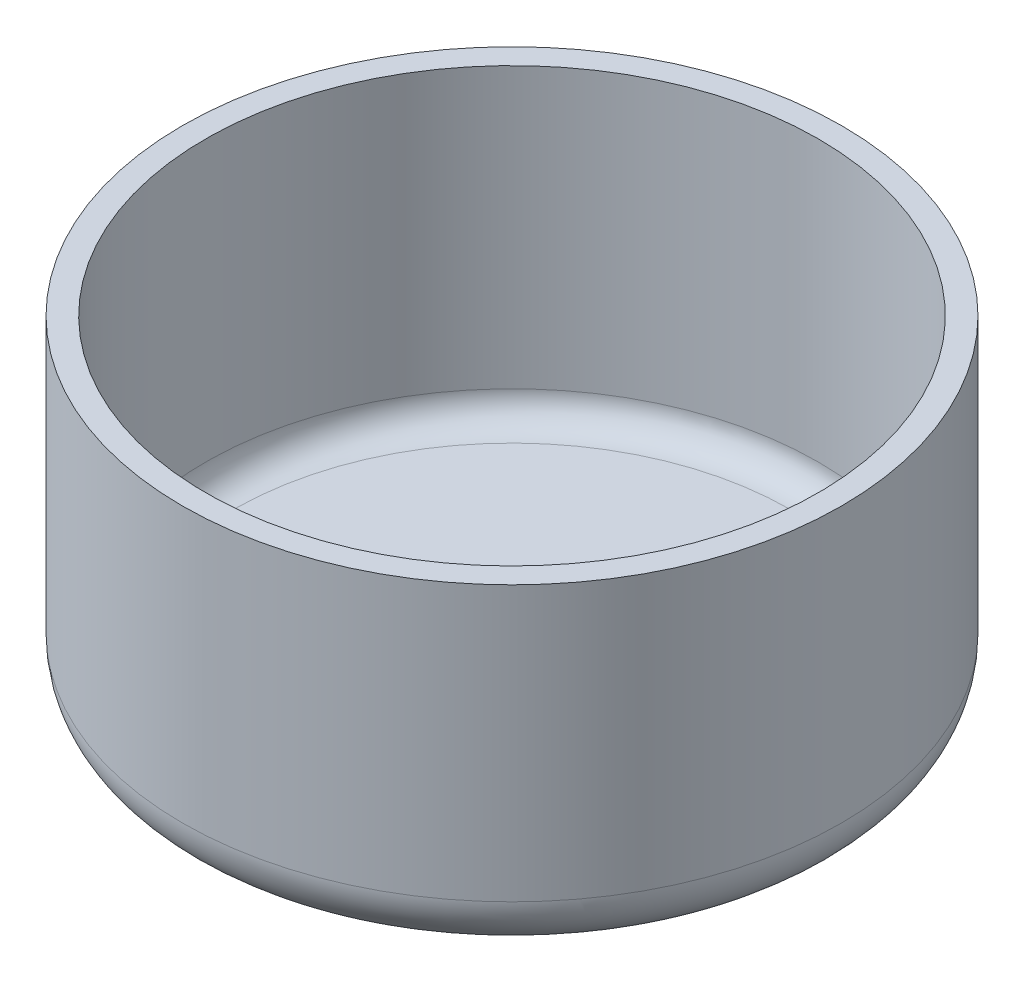
ISO-10303-21;
HEADER;
FILE_DESCRIPTION(('STEP AP214'),'2;1');
FILE_NAME('part.step','',(''),(''),'','','');
FILE_SCHEMA(('AUTOMOTIVE_DESIGN { 1 0 10303 214 1 1 1 1 }'));
ENDSEC;
DATA;
#1=APPLICATION_CONTEXT('core data for automotive mechanical design processes');
#2=APPLICATION_PROTOCOL_DEFINITION('international standard','automotive_design',2000,#1);
#3=PRODUCT_CONTEXT('',#1,'mechanical');
#4=PRODUCT('Part','Part','',(#3));
#5=PRODUCT_RELATED_PRODUCT_CATEGORY('part','',(#4));
#6=PRODUCT_DEFINITION_FORMATION('','',#4);
#7=PRODUCT_DEFINITION_CONTEXT('part definition',#1,'design');
#8=PRODUCT_DEFINITION('design','',#6,#7);
#9=PRODUCT_DEFINITION_SHAPE('','',#8);
#10=(LENGTH_UNIT() NAMED_UNIT(*) SI_UNIT(.MILLI.,.METRE.));
#11=(NAMED_UNIT(*) PLANE_ANGLE_UNIT() SI_UNIT($,.RADIAN.));
#12=(NAMED_UNIT(*) SI_UNIT($,.STERADIAN.) SOLID_ANGLE_UNIT());
#13=UNCERTAINTY_MEASURE_WITH_UNIT(LENGTH_MEASURE(1.E-05),#10,'distance_accuracy_value','');
#14=(GEOMETRIC_REPRESENTATION_CONTEXT(3) GLOBAL_UNCERTAINTY_ASSIGNED_CONTEXT((#13)) GLOBAL_UNIT_ASSIGNED_CONTEXT((#10,
#11,#12)) REPRESENTATION_CONTEXT('',''));
#15=CARTESIAN_POINT('',(0.,0.,0.));
#16=DIRECTION('',(0.,0.,1.));
#17=DIRECTION('',(1.,0.,0.));
#18=AXIS2_PLACEMENT_3D('',#15,#16,#17);
#19=CARTESIAN_POINT('',(0.,0.,0.));
#20=DIRECTION('',(0.,-1.,0.));
#21=DIRECTION('',(0.,0.,-1.));
#22=AXIS2_PLACEMENT_3D('',#19,#20,#21);
#23=CYLINDRICAL_SURFACE('',#22,3.302);
#24=CARTESIAN_POINT('',(0.,0.,0.));
#25=DIRECTION('',(0.,-1.,0.));
#26=DIRECTION('',(0.,0.,-1.));
#27=AXIS2_PLACEMENT_3D('',#24,#25,#26);
#28=CIRCLE('',#27,3.302);
#29=CARTESIAN_POINT('',(0.,0.,-3.302));
#30=VERTEX_POINT('',#29);
#31=EDGE_CURVE('E10',#30,#30,#28,.T.);
#32=ORIENTED_EDGE('',*,*,#31,.T.);
#33=EDGE_LOOP('',(#32));
#34=FACE_BOUND('',#33,.T.);
#35=CARTESIAN_POINT('',(0.,0.8382,0.));
#36=DIRECTION('',(0.,-1.,0.));
#37=DIRECTION('',(0.,0.,-1.));
#38=AXIS2_PLACEMENT_3D('',#35,#36,#37);
#39=CIRCLE('',#38,3.302);
#40=CARTESIAN_POINT('',(0.,0.8382,-3.302));
#41=VERTEX_POINT('',#40);
#42=EDGE_CURVE('E61',#41,#41,#39,.T.);
#43=ORIENTED_EDGE('',*,*,#42,.F.);
#44=EDGE_LOOP('',(#43));
#45=FACE_BOUND('',#44,.T.);
#46=ADVANCED_FACE('F33',(#34,#45),#23,.F.);
#47=CARTESIAN_POINT('',(3.302,0.,0.));
#48=DIRECTION('',(0.,-1.,0.));
#49=DIRECTION('',(0.,0.,-1.));
#50=AXIS2_PLACEMENT_3D('',#47,#48,#49);
#51=PLANE('',#50);
#52=CARTESIAN_POINT('',(0.,0.,0.));
#53=DIRECTION('',(0.,-1.,0.));
#54=DIRECTION('',(0.,0.,-1.));
#55=AXIS2_PLACEMENT_3D('',#52,#53,#54);
#56=CIRCLE('',#55,9.9314);
#57=CARTESIAN_POINT('',(0.,0.,-9.9314));
#58=VERTEX_POINT('',#57);
#59=EDGE_CURVE('E39',#58,#58,#56,.T.);
#60=ORIENTED_EDGE('',*,*,#59,.T.);
#61=EDGE_LOOP('',(#60));
#62=FACE_BOUND('',#61,.T.);
#63=ORIENTED_EDGE('',*,*,#31,.F.);
#64=EDGE_LOOP('',(#63));
#65=FACE_BOUND('',#64,.T.);
#66=ADVANCED_FACE('F69',(#62,#65),#51,.T.);
#67=CARTESIAN_POINT('',(0.,2.032,0.));
#68=DIRECTION('',(0.,-1.,0.));
#69=DIRECTION('',(0.,0.,-1.));
#70=AXIS2_PLACEMENT_3D('',#67,#68,#69);
#71=TOROIDAL_SURFACE('',#70,9.9314,2.032);
#72=CARTESIAN_POINT('',(0.,2.032,0.));
#73=DIRECTION('',(0.,-1.,0.));
#74=DIRECTION('',(0.,0.,-1.));
#75=AXIS2_PLACEMENT_3D('',#72,#73,#74);
#76=CIRCLE('',#75,11.9634);
#77=CARTESIAN_POINT('',(0.,2.032,-11.9634));
#78=VERTEX_POINT('',#77);
#79=EDGE_CURVE('E43',#78,#78,#76,.T.);
#80=ORIENTED_EDGE('',*,*,#79,.T.);
#81=EDGE_LOOP('',(#80));
#82=FACE_BOUND('',#81,.T.);
#83=ORIENTED_EDGE('',*,*,#59,.F.);
#84=EDGE_LOOP('',(#83));
#85=FACE_BOUND('',#84,.T.);
#86=ADVANCED_FACE('F73',(#82,#85),#71,.T.);
#87=CARTESIAN_POINT('',(0.,0.,0.));
#88=DIRECTION('',(0.,-1.,0.));
#89=DIRECTION('',(0.,0.,-1.));
#90=AXIS2_PLACEMENT_3D('',#87,#88,#89);
#91=CYLINDRICAL_SURFACE('',#90,11.9634);
#92=CARTESIAN_POINT('',(0.,12.,0.));
#93=DIRECTION('',(0.,-1.,0.));
#94=DIRECTION('',(0.,0.,-1.));
#95=AXIS2_PLACEMENT_3D('',#92,#93,#94);
#96=CIRCLE('',#95,11.9634);
#97=CARTESIAN_POINT('',(0.,12.,-11.9634));
#98=VERTEX_POINT('',#97);
#99=EDGE_CURVE('E47',#98,#98,#96,.T.);
#100=ORIENTED_EDGE('',*,*,#99,.T.);
#101=EDGE_LOOP('',(#100));
#102=FACE_BOUND('',#101,.T.);
#103=ORIENTED_EDGE('',*,*,#79,.F.);
#104=EDGE_LOOP('',(#103));
#105=FACE_BOUND('',#104,.T.);
#106=ADVANCED_FACE('F77',(#102,#105),#91,.T.);
#107=CARTESIAN_POINT('',(11.1252,12.,0.));
#108=DIRECTION('',(0.,1.,0.));
#109=DIRECTION('',(0.,0.,1.));
#110=AXIS2_PLACEMENT_3D('',#107,#108,#109);
#111=PLANE('',#110);
#112=CARTESIAN_POINT('',(0.,12.,0.));
#113=DIRECTION('',(0.,-1.,0.));
#114=DIRECTION('',(0.,0.,-1.));
#115=AXIS2_PLACEMENT_3D('',#112,#113,#114);
#116=CIRCLE('',#115,11.1252);
#117=CARTESIAN_POINT('',(0.,12.,-11.1252));
#118=VERTEX_POINT('',#117);
#119=EDGE_CURVE('E52',#118,#118,#116,.T.);
#120=ORIENTED_EDGE('',*,*,#119,.T.);
#121=EDGE_LOOP('',(#120));
#122=FACE_BOUND('',#121,.T.);
#123=ORIENTED_EDGE('',*,*,#99,.F.);
#124=EDGE_LOOP('',(#123));
#125=FACE_BOUND('',#124,.T.);
#126=ADVANCED_FACE('F84',(#122,#125),#111,.T.);
#127=CARTESIAN_POINT('',(0.,0.,0.));
#128=DIRECTION('',(0.,-1.,0.));
#129=DIRECTION('',(0.,0.,-1.));
#130=AXIS2_PLACEMENT_3D('',#127,#128,#129);
#131=CYLINDRICAL_SURFACE('',#130,11.1252);
#132=CARTESIAN_POINT('',(0.,1.8382,0.));
#133=DIRECTION('',(0.,-1.,0.));
#134=DIRECTION('',(0.,0.,-1.));
#135=AXIS2_PLACEMENT_3D('',#132,#133,#134);
#136=CIRCLE('',#135,11.1252);
#137=CARTESIAN_POINT('',(0.,1.8382,-11.1252));
#138=VERTEX_POINT('',#137);
#139=EDGE_CURVE('E55',#138,#138,#136,.T.);
#140=ORIENTED_EDGE('',*,*,#139,.T.);
#141=EDGE_LOOP('',(#140));
#142=FACE_BOUND('',#141,.T.);
#143=ORIENTED_EDGE('',*,*,#119,.F.);
#144=EDGE_LOOP('',(#143));
#145=FACE_BOUND('',#144,.T.);
#146=ADVANCED_FACE('F88',(#142,#145),#131,.F.);
#147=CARTESIAN_POINT('',(0.,1.8382,0.));
#148=DIRECTION('',(0.,-1.,0.));
#149=DIRECTION('',(0.,0.,-1.));
#150=AXIS2_PLACEMENT_3D('',#147,#148,#149);
#151=TOROIDAL_SURFACE('',#150,10.1252,1.);
#152=CARTESIAN_POINT('',(0.,0.8382,0.));
#153=DIRECTION('',(0.,-1.,0.));
#154=DIRECTION('',(0.,0.,-1.));
#155=AXIS2_PLACEMENT_3D('',#152,#153,#154);
#156=CIRCLE('',#155,10.1252);
#157=CARTESIAN_POINT('',(0.,0.8382,-10.1252));
#158=VERTEX_POINT('',#157);
#159=EDGE_CURVE('E58',#158,#158,#156,.T.);
#160=ORIENTED_EDGE('',*,*,#159,.T.);
#161=EDGE_LOOP('',(#160));
#162=FACE_BOUND('',#161,.T.);
#163=ORIENTED_EDGE('',*,*,#139,.F.);
#164=EDGE_LOOP('',(#163));
#165=FACE_BOUND('',#164,.T.);
#166=ADVANCED_FACE('F92',(#162,#165),#151,.F.);
#167=CARTESIAN_POINT('',(3.302,0.8382,0.));
#168=DIRECTION('',(0.,1.,0.));
#169=DIRECTION('',(0.,0.,1.));
#170=AXIS2_PLACEMENT_3D('',#167,#168,#169);
#171=PLANE('',#170);
#172=ORIENTED_EDGE('',*,*,#42,.T.);
#173=EDGE_LOOP('',(#172));
#174=FACE_BOUND('',#173,.T.);
#175=ORIENTED_EDGE('',*,*,#159,.F.);
#176=EDGE_LOOP('',(#175));
#177=FACE_BOUND('',#176,.T.);
#178=ADVANCED_FACE('F65',(#174,#177),#171,.T.);
#179=CLOSED_SHELL('',(#46,#66,#86,#106,#126,#146,#166,#178));
#180=MANIFOLD_SOLID_BREP('B2',#179);
#181=ADVANCED_BREP_SHAPE_REPRESENTATION('',(#18,#180),#14);
#182=SHAPE_DEFINITION_REPRESENTATION(#9,#181);
ENDSEC;
END-ISO-10303-21;
